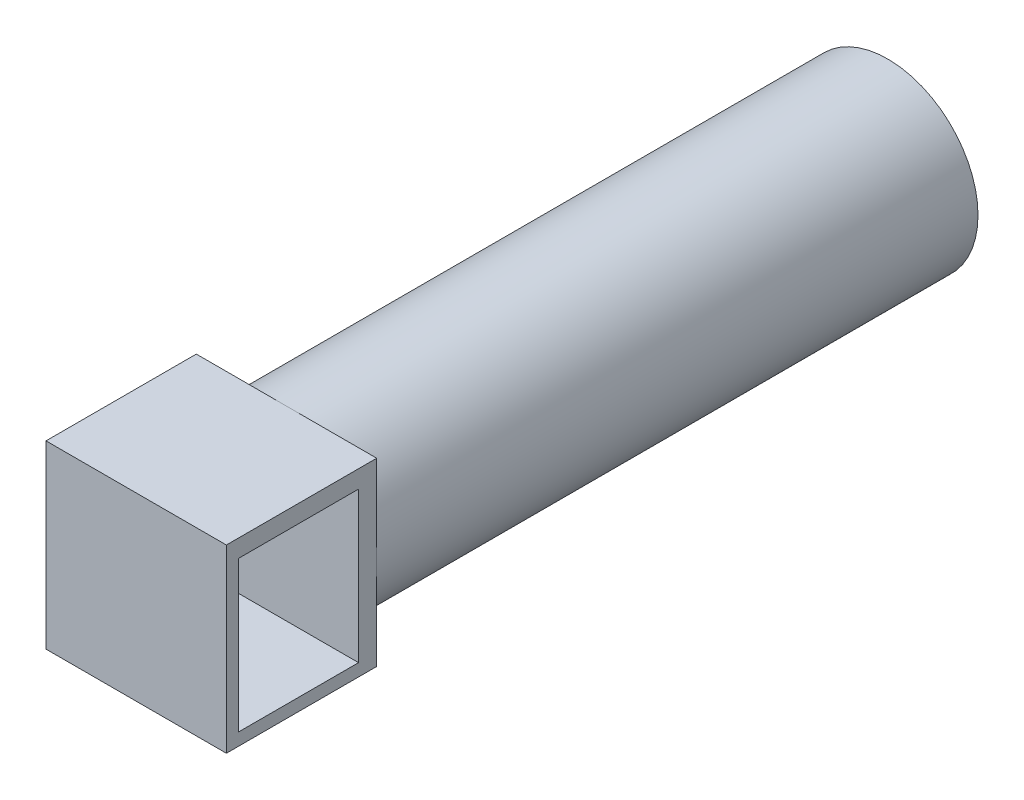
ISO-10303-21;
HEADER;
FILE_DESCRIPTION(('STEP AP214'),'2;1');
FILE_NAME('part.step','',(''),(''),'','','');
FILE_SCHEMA(('AUTOMOTIVE_DESIGN { 1 0 10303 214 1 1 1 1 }'));
ENDSEC;
DATA;
#1=APPLICATION_CONTEXT('core data for automotive mechanical design processes');
#2=APPLICATION_PROTOCOL_DEFINITION('international standard','automotive_design',2000,#1);
#3=PRODUCT_CONTEXT('',#1,'mechanical');
#4=PRODUCT('Part','Part','',(#3));
#5=PRODUCT_RELATED_PRODUCT_CATEGORY('part','',(#4));
#6=PRODUCT_DEFINITION_FORMATION('','',#4);
#7=PRODUCT_DEFINITION_CONTEXT('part definition',#1,'design');
#8=PRODUCT_DEFINITION('design','',#6,#7);
#9=PRODUCT_DEFINITION_SHAPE('','',#8);
#10=(LENGTH_UNIT() NAMED_UNIT(*) SI_UNIT(.MILLI.,.METRE.));
#11=(NAMED_UNIT(*) PLANE_ANGLE_UNIT() SI_UNIT($,.RADIAN.));
#12=(NAMED_UNIT(*) SI_UNIT($,.STERADIAN.) SOLID_ANGLE_UNIT());
#13=UNCERTAINTY_MEASURE_WITH_UNIT(LENGTH_MEASURE(1.E-05),#10,'distance_accuracy_value','');
#14=(GEOMETRIC_REPRESENTATION_CONTEXT(3) GLOBAL_UNCERTAINTY_ASSIGNED_CONTEXT((#13)) GLOBAL_UNIT_ASSIGNED_CONTEXT((#10,
#11,#12)) REPRESENTATION_CONTEXT('',''));
#15=CARTESIAN_POINT('',(0.,0.,0.));
#16=DIRECTION('',(0.,0.,1.));
#17=DIRECTION('',(1.,0.,0.));
#18=AXIS2_PLACEMENT_3D('',#15,#16,#17);
#19=CARTESIAN_POINT('',(0.,0.,200.));
#20=DIRECTION('',(0.,0.,-1.));
#21=DIRECTION('',(-1.,0.,0.));
#22=AXIS2_PLACEMENT_3D('',#19,#20,#21);
#23=CYLINDRICAL_SURFACE('',#22,30.);
#24=CARTESIAN_POINT('',(0.,0.,200.));
#25=DIRECTION('',(0.,0.,1.));
#26=DIRECTION('',(1.,0.,0.));
#27=AXIS2_PLACEMENT_3D('',#24,#25,#26);
#28=CIRCLE('',#27,30.);
#29=CARTESIAN_POINT('',(30.,0.,200.));
#30=VERTEX_POINT('',#29);
#31=CARTESIAN_POINT('',(0.,30.,200.));
#32=VERTEX_POINT('',#31);
#33=EDGE_CURVE('E11',#30,#32,#28,.T.);
#34=ORIENTED_EDGE('',*,*,#33,.F.);
#35=CARTESIAN_POINT('',(0.,-30.,200.));
#36=VERTEX_POINT('',#35);
#37=EDGE_CURVE('E42',#36,#30,#28,.T.);
#38=ORIENTED_EDGE('',*,*,#37,.F.);
#39=CARTESIAN_POINT('',(-30.,0.,200.));
#40=VERTEX_POINT('',#39);
#41=EDGE_CURVE('E218',#40,#36,#28,.T.);
#42=ORIENTED_EDGE('',*,*,#41,.F.);
#43=EDGE_CURVE('E41',#32,#40,#28,.T.);
#44=ORIENTED_EDGE('',*,*,#43,.F.);
#45=EDGE_LOOP('',(#34,#38,#42,#44));
#46=FACE_BOUND('',#45,.T.);
#47=CARTESIAN_POINT('',(0.,0.,0.));
#48=DIRECTION('',(0.,0.,1.));
#49=DIRECTION('',(1.,0.,0.));
#50=AXIS2_PLACEMENT_3D('',#47,#48,#49);
#51=CIRCLE('',#50,30.);
#52=CARTESIAN_POINT('',(30.,0.,0.));
#53=VERTEX_POINT('',#52);
#54=EDGE_CURVE('E36',#53,#53,#51,.T.);
#55=ORIENTED_EDGE('',*,*,#54,.T.);
#56=EDGE_LOOP('',(#55));
#57=FACE_BOUND('',#56,.T.);
#58=ADVANCED_FACE('F33',(#46,#57),#23,.T.);
#59=CARTESIAN_POINT('',(0.,0.,0.));
#60=DIRECTION('',(0.,0.,1.));
#61=DIRECTION('',(1.,0.,0.));
#62=AXIS2_PLACEMENT_3D('',#59,#60,#61);
#63=PLANE('',#62);
#64=ORIENTED_EDGE('',*,*,#54,.F.);
#65=EDGE_LOOP('',(#64));
#66=FACE_BOUND('',#65,.T.);
#67=ADVANCED_FACE('F229',(#66),#63,.F.);
#68=CARTESIAN_POINT('',(30.,30.,200.));
#69=DIRECTION('',(0.,0.,1.));
#70=DIRECTION('',(1.,0.,0.));
#71=AXIS2_PLACEMENT_3D('',#68,#69,#70);
#72=PLANE('',#71);
#73=DIRECTION('',(0.,1.,0.));
#74=VECTOR('',#73,1.);
#75=CARTESIAN_POINT('',(30.,30.,200.));
#76=LINE('',#75,#74);
#77=CARTESIAN_POINT('',(30.,30.,200.));
#78=VERTEX_POINT('',#77);
#79=EDGE_CURVE('E152',#30,#78,#76,.T.);
#80=ORIENTED_EDGE('',*,*,#79,.F.);
#81=ORIENTED_EDGE('',*,*,#33,.T.);
#82=DIRECTION('',(-1.,0.,0.));
#83=VECTOR('',#82,1.);
#84=CARTESIAN_POINT('',(30.,30.,200.));
#85=LINE('',#84,#83);
#86=EDGE_CURVE('E179',#78,#32,#85,.T.);
#87=ORIENTED_EDGE('',*,*,#86,.F.);
#88=EDGE_LOOP('',(#80,#81,#87));
#89=FACE_BOUND('',#88,.T.);
#90=ADVANCED_FACE('F211',(#89),#72,.F.);
#91=CARTESIAN_POINT('',(-30.,30.,200.));
#92=VERTEX_POINT('',#91);
#93=EDGE_CURVE('E178',#32,#92,#85,.T.);
#94=ORIENTED_EDGE('',*,*,#93,.F.);
#95=ORIENTED_EDGE('',*,*,#43,.T.);
#96=DIRECTION('',(0.,1.,0.));
#97=VECTOR('',#96,1.);
#98=CARTESIAN_POINT('',(-30.,30.,200.));
#99=LINE('',#98,#97);
#100=EDGE_CURVE('E144',#40,#92,#99,.T.);
#101=ORIENTED_EDGE('',*,*,#100,.T.);
#102=EDGE_LOOP('',(#94,#95,#101));
#103=FACE_BOUND('',#102,.T.);
#104=ADVANCED_FACE('F193',(#103),#72,.F.);
#105=CARTESIAN_POINT('',(-30.,-30.,200.));
#106=VERTEX_POINT('',#105);
#107=EDGE_CURVE('E159',#106,#40,#99,.T.);
#108=ORIENTED_EDGE('',*,*,#107,.T.);
#109=ORIENTED_EDGE('',*,*,#41,.T.);
#110=DIRECTION('',(-1.,0.,0.));
#111=VECTOR('',#110,1.);
#112=CARTESIAN_POINT('',(30.,-30.,200.));
#113=LINE('',#112,#111);
#114=EDGE_CURVE('E158',#36,#106,#113,.T.);
#115=ORIENTED_EDGE('',*,*,#114,.T.);
#116=EDGE_LOOP('',(#108,#109,#115));
#117=FACE_BOUND('',#116,.T.);
#118=ADVANCED_FACE('F220',(#117),#72,.F.);
#119=CARTESIAN_POINT('',(30.,-30.,200.));
#120=VERTEX_POINT('',#119);
#121=EDGE_CURVE('E169',#120,#36,#113,.T.);
#122=ORIENTED_EDGE('',*,*,#121,.T.);
#123=ORIENTED_EDGE('',*,*,#37,.T.);
#124=EDGE_CURVE('E148',#120,#30,#76,.T.);
#125=ORIENTED_EDGE('',*,*,#124,.F.);
#126=EDGE_LOOP('',(#122,#123,#125));
#127=FACE_BOUND('',#126,.T.);
#128=ADVANCED_FACE('F217',(#127),#72,.F.);
#129=CARTESIAN_POINT('',(30.,30.,200.));
#130=DIRECTION('',(0.,-1.,0.));
#131=DIRECTION('',(0.,0.,-1.));
#132=AXIS2_PLACEMENT_3D('',#129,#130,#131);
#133=PLANE('',#132);
#134=DIRECTION('',(0.,0.,1.));
#135=VECTOR('',#134,1.);
#136=CARTESIAN_POINT('',(-30.,30.,200.));
#137=LINE('',#136,#135);
#138=CARTESIAN_POINT('',(-30.,30.,250.));
#139=VERTEX_POINT('',#138);
#140=EDGE_CURVE('E162',#92,#139,#137,.T.);
#141=ORIENTED_EDGE('',*,*,#140,.T.);
#142=DIRECTION('',(-1.,0.,0.));
#143=VECTOR('',#142,1.);
#144=CARTESIAN_POINT('',(30.,30.,250.));
#145=LINE('',#144,#143);
#146=CARTESIAN_POINT('',(30.,30.,250.));
#147=VERTEX_POINT('',#146);
#148=EDGE_CURVE('E175',#147,#139,#145,.T.);
#149=ORIENTED_EDGE('',*,*,#148,.F.);
#150=DIRECTION('',(0.,0.,1.));
#151=VECTOR('',#150,1.);
#152=CARTESIAN_POINT('',(30.,30.,200.));
#153=LINE('',#152,#151);
#154=EDGE_CURVE('E151',#78,#147,#153,.T.);
#155=ORIENTED_EDGE('',*,*,#154,.F.);
#156=ORIENTED_EDGE('',*,*,#86,.T.);
#157=ORIENTED_EDGE('',*,*,#93,.T.);
#158=EDGE_LOOP('',(#141,#149,#155,#156,#157));
#159=FACE_BOUND('',#158,.T.);
#160=ADVANCED_FACE('F187',(#159),#133,.F.);
#161=CARTESIAN_POINT('',(30.,30.,250.));
#162=DIRECTION('',(0.,0.,-1.));
#163=DIRECTION('',(-1.,0.,0.));
#164=AXIS2_PLACEMENT_3D('',#161,#162,#163);
#165=PLANE('',#164);
#166=DIRECTION('',(0.,-1.,0.));
#167=VECTOR('',#166,1.);
#168=CARTESIAN_POINT('',(-30.,30.,250.));
#169=LINE('',#168,#167);
#170=CARTESIAN_POINT('',(-30.,-30.,250.));
#171=VERTEX_POINT('',#170);
#172=EDGE_CURVE('E164',#139,#171,#169,.T.);
#173=ORIENTED_EDGE('',*,*,#172,.T.);
#174=DIRECTION('',(-1.,0.,0.));
#175=VECTOR('',#174,1.);
#176=CARTESIAN_POINT('',(30.,-30.,250.));
#177=LINE('',#176,#175);
#178=CARTESIAN_POINT('',(30.,-30.,250.));
#179=VERTEX_POINT('',#178);
#180=EDGE_CURVE('E172',#179,#171,#177,.T.);
#181=ORIENTED_EDGE('',*,*,#180,.F.);
#182=DIRECTION('',(0.,-1.,0.));
#183=VECTOR('',#182,1.);
#184=CARTESIAN_POINT('',(30.,30.,250.));
#185=LINE('',#184,#183);
#186=EDGE_CURVE('E154',#147,#179,#185,.T.);
#187=ORIENTED_EDGE('',*,*,#186,.F.);
#188=ORIENTED_EDGE('',*,*,#148,.T.);
#189=EDGE_LOOP('',(#173,#181,#187,#188));
#190=FACE_BOUND('',#189,.T.);
#191=ADVANCED_FACE('F199',(#190),#165,.F.);
#192=CARTESIAN_POINT('',(30.,-30.,200.));
#193=DIRECTION('',(0.,1.,0.));
#194=DIRECTION('',(0.,0.,1.));
#195=AXIS2_PLACEMENT_3D('',#192,#193,#194);
#196=PLANE('',#195);
#197=DIRECTION('',(0.,0.,-1.));
#198=VECTOR('',#197,1.);
#199=CARTESIAN_POINT('',(-30.,-30.,200.));
#200=LINE('',#199,#198);
#201=EDGE_CURVE('E166',#171,#106,#200,.T.);
#202=ORIENTED_EDGE('',*,*,#201,.T.);
#203=ORIENTED_EDGE('',*,*,#114,.F.);
#204=ORIENTED_EDGE('',*,*,#121,.F.);
#205=DIRECTION('',(0.,0.,-1.));
#206=VECTOR('',#205,1.);
#207=CARTESIAN_POINT('',(30.,-30.,200.));
#208=LINE('',#207,#206);
#209=EDGE_CURVE('E156',#179,#120,#208,.T.);
#210=ORIENTED_EDGE('',*,*,#209,.F.);
#211=ORIENTED_EDGE('',*,*,#180,.T.);
#212=EDGE_LOOP('',(#202,#203,#204,#210,#211));
#213=FACE_BOUND('',#212,.T.);
#214=ADVANCED_FACE('F203',(#213),#196,.F.);
#215=CARTESIAN_POINT('',(30.,0.,0.));
#216=DIRECTION('',(-1.,0.,0.));
#217=DIRECTION('',(0.,0.,1.));
#218=AXIS2_PLACEMENT_3D('',#215,#216,#217);
#219=PLANE('',#218);
#220=DIRECTION('',(0.,0.,-1.));
#221=VECTOR('',#220,1.);
#222=CARTESIAN_POINT('',(30.,-25.8739237368581,206.037911191847));
#223=LINE('',#222,#221);
#224=CARTESIAN_POINT('',(30.,-25.8739237368581,246.037911191847));
#225=VERTEX_POINT('',#224);
#226=CARTESIAN_POINT('',(30.,-25.8739237368581,206.037911191847));
#227=VERTEX_POINT('',#226);
#228=EDGE_CURVE('E138',#225,#227,#223,.T.);
#229=ORIENTED_EDGE('',*,*,#228,.F.);
#230=DIRECTION('',(0.,-1.,0.));
#231=VECTOR('',#230,1.);
#232=CARTESIAN_POINT('',(30.,24.1260762631419,246.037911191847));
#233=LINE('',#232,#231);
#234=CARTESIAN_POINT('',(30.,24.1260762631419,246.037911191847));
#235=VERTEX_POINT('',#234);
#236=EDGE_CURVE('E49',#235,#225,#233,.T.);
#237=ORIENTED_EDGE('',*,*,#236,.F.);
#238=DIRECTION('',(0.,0.,1.));
#239=VECTOR('',#238,1.);
#240=CARTESIAN_POINT('',(30.,24.126076263142,206.037911191847));
#241=LINE('',#240,#239);
#242=CARTESIAN_POINT('',(30.,24.126076263142,206.037911191847));
#243=VERTEX_POINT('',#242);
#244=EDGE_CURVE('E129',#243,#235,#241,.T.);
#245=ORIENTED_EDGE('',*,*,#244,.F.);
#246=DIRECTION('',(0.,1.,0.));
#247=VECTOR('',#246,1.);
#248=CARTESIAN_POINT('',(30.,24.126076263142,206.037911191847));
#249=LINE('',#248,#247);
#250=EDGE_CURVE('E132',#227,#243,#249,.T.);
#251=ORIENTED_EDGE('',*,*,#250,.F.);
#252=EDGE_LOOP('',(#229,#237,#245,#251));
#253=FACE_BOUND('',#252,.T.);
#254=ORIENTED_EDGE('',*,*,#124,.T.);
#255=ORIENTED_EDGE('',*,*,#79,.T.);
#256=ORIENTED_EDGE('',*,*,#154,.T.);
#257=ORIENTED_EDGE('',*,*,#186,.T.);
#258=ORIENTED_EDGE('',*,*,#209,.T.);
#259=EDGE_LOOP('',(#254,#255,#256,#257,#258));
#260=FACE_BOUND('',#259,.T.);
#261=ADVANCED_FACE('F208',(#253,#260),#219,.F.);
#262=CARTESIAN_POINT('',(-30.,0.,0.));
#263=DIRECTION('',(-1.,0.,0.));
#264=DIRECTION('',(0.,0.,1.));
#265=AXIS2_PLACEMENT_3D('',#262,#263,#264);
#266=PLANE('',#265);
#267=DIRECTION('',(0.,-1.,0.));
#268=VECTOR('',#267,1.);
#269=CARTESIAN_POINT('',(-30.,24.1260762631419,246.037911191847));
#270=LINE('',#269,#268);
#271=CARTESIAN_POINT('',(-30.,24.1260762631419,246.037911191847));
#272=VERTEX_POINT('',#271);
#273=CARTESIAN_POINT('',(-30.,-25.8739237368581,246.037911191847));
#274=VERTEX_POINT('',#273);
#275=EDGE_CURVE('E113',#272,#274,#270,.T.);
#276=ORIENTED_EDGE('',*,*,#275,.T.);
#277=DIRECTION('',(0.,0.,-1.));
#278=VECTOR('',#277,1.);
#279=CARTESIAN_POINT('',(-30.,-25.8739237368581,206.037911191847));
#280=LINE('',#279,#278);
#281=CARTESIAN_POINT('',(-30.,-25.8739237368581,206.037911191847));
#282=VERTEX_POINT('',#281);
#283=EDGE_CURVE('E122',#274,#282,#280,.T.);
#284=ORIENTED_EDGE('',*,*,#283,.T.);
#285=DIRECTION('',(0.,1.,0.));
#286=VECTOR('',#285,1.);
#287=CARTESIAN_POINT('',(-30.,24.126076263142,206.037911191847));
#288=LINE('',#287,#286);
#289=CARTESIAN_POINT('',(-30.,24.126076263142,206.037911191847));
#290=VERTEX_POINT('',#289);
#291=EDGE_CURVE('E57',#282,#290,#288,.T.);
#292=ORIENTED_EDGE('',*,*,#291,.T.);
#293=DIRECTION('',(0.,0.,1.));
#294=VECTOR('',#293,1.);
#295=CARTESIAN_POINT('',(-30.,24.126076263142,206.037911191847));
#296=LINE('',#295,#294);
#297=EDGE_CURVE('E119',#290,#272,#296,.T.);
#298=ORIENTED_EDGE('',*,*,#297,.T.);
#299=EDGE_LOOP('',(#276,#284,#292,#298));
#300=FACE_BOUND('',#299,.T.);
#301=ORIENTED_EDGE('',*,*,#107,.F.);
#302=ORIENTED_EDGE('',*,*,#201,.F.);
#303=ORIENTED_EDGE('',*,*,#172,.F.);
#304=ORIENTED_EDGE('',*,*,#140,.F.);
#305=ORIENTED_EDGE('',*,*,#100,.F.);
#306=EDGE_LOOP('',(#301,#302,#303,#304,#305));
#307=FACE_BOUND('',#306,.T.);
#308=ADVANCED_FACE('F126',(#300,#307),#266,.T.);
#309=CARTESIAN_POINT('',(-30.,24.1260762631419,246.037911191847));
#310=DIRECTION('',(0.,0.,1.));
#311=DIRECTION('',(1.,0.,0.));
#312=AXIS2_PLACEMENT_3D('',#309,#310,#311);
#313=PLANE('',#312);
#314=ORIENTED_EDGE('',*,*,#236,.T.);
#315=DIRECTION('',(1.,0.,0.));
#316=VECTOR('',#315,1.);
#317=CARTESIAN_POINT('',(-30.,-25.8739237368581,246.037911191847));
#318=LINE('',#317,#316);
#319=EDGE_CURVE('E109',#274,#225,#318,.T.);
#320=ORIENTED_EDGE('',*,*,#319,.F.);
#321=ORIENTED_EDGE('',*,*,#275,.F.);
#322=DIRECTION('',(1.,0.,0.));
#323=VECTOR('',#322,1.);
#324=CARTESIAN_POINT('',(-30.,24.1260762631419,246.037911191847));
#325=LINE('',#324,#323);
#326=EDGE_CURVE('E142',#272,#235,#325,.T.);
#327=ORIENTED_EDGE('',*,*,#326,.T.);
#328=EDGE_LOOP('',(#314,#320,#321,#327));
#329=FACE_BOUND('',#328,.T.);
#330=ADVANCED_FACE('F111',(#329),#313,.F.);
#331=CARTESIAN_POINT('',(-30.,24.126076263142,206.037911191847));
#332=DIRECTION('',(0.,1.,0.));
#333=DIRECTION('',(0.,0.,1.));
#334=AXIS2_PLACEMENT_3D('',#331,#332,#333);
#335=PLANE('',#334);
#336=ORIENTED_EDGE('',*,*,#244,.T.);
#337=ORIENTED_EDGE('',*,*,#326,.F.);
#338=ORIENTED_EDGE('',*,*,#297,.F.);
#339=DIRECTION('',(1.,0.,0.));
#340=VECTOR('',#339,1.);
#341=CARTESIAN_POINT('',(-30.,24.126076263142,206.037911191847));
#342=LINE('',#341,#340);
#343=EDGE_CURVE('E145',#290,#243,#342,.T.);
#344=ORIENTED_EDGE('',*,*,#343,.T.);
#345=EDGE_LOOP('',(#336,#337,#338,#344));
#346=FACE_BOUND('',#345,.T.);
#347=ADVANCED_FACE('F303',(#346),#335,.F.);
#348=CARTESIAN_POINT('',(-30.,24.126076263142,206.037911191847));
#349=DIRECTION('',(0.,0.,-1.));
#350=DIRECTION('',(-1.,0.,0.));
#351=AXIS2_PLACEMENT_3D('',#348,#349,#350);
#352=PLANE('',#351);
#353=ORIENTED_EDGE('',*,*,#250,.T.);
#354=ORIENTED_EDGE('',*,*,#343,.F.);
#355=ORIENTED_EDGE('',*,*,#291,.F.);
#356=DIRECTION('',(1.,0.,0.));
#357=VECTOR('',#356,1.);
#358=CARTESIAN_POINT('',(-30.,-25.8739237368581,206.037911191847));
#359=LINE('',#358,#357);
#360=EDGE_CURVE('E118',#282,#227,#359,.T.);
#361=ORIENTED_EDGE('',*,*,#360,.T.);
#362=EDGE_LOOP('',(#353,#354,#355,#361));
#363=FACE_BOUND('',#362,.T.);
#364=ADVANCED_FACE('F312',(#363),#352,.F.);
#365=CARTESIAN_POINT('',(-30.,-25.8739237368581,206.037911191847));
#366=DIRECTION('',(0.,-1.,0.));
#367=DIRECTION('',(0.,0.,-1.));
#368=AXIS2_PLACEMENT_3D('',#365,#366,#367);
#369=PLANE('',#368);
#370=ORIENTED_EDGE('',*,*,#228,.T.);
#371=ORIENTED_EDGE('',*,*,#360,.F.);
#372=ORIENTED_EDGE('',*,*,#283,.F.);
#373=ORIENTED_EDGE('',*,*,#319,.T.);
#374=EDGE_LOOP('',(#370,#371,#372,#373));
#375=FACE_BOUND('',#374,.T.);
#376=ADVANCED_FACE('F123',(#375),#369,.F.);
#377=CLOSED_SHELL('',(#58,#67,#90,#104,#118,#128,#160,#191,#214,#261,#308,#330,#347,#364,#376));
#378=MANIFOLD_SOLID_BREP('B2',#377);
#379=ADVANCED_BREP_SHAPE_REPRESENTATION('',(#18,#378),#14);
#380=SHAPE_DEFINITION_REPRESENTATION(#9,#379);
ENDSEC;
END-ISO-10303-21;
